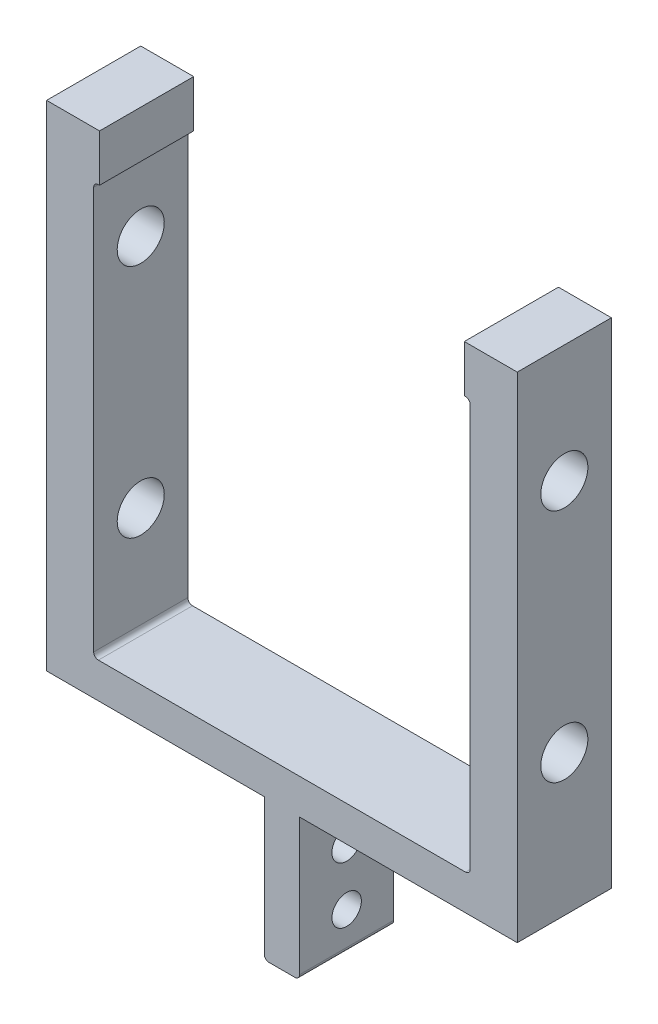
ISO-10303-21;
HEADER;
FILE_DESCRIPTION(('STEP AP214'),'2;1');
FILE_NAME('part.step','',(''),(''),'','','');
FILE_SCHEMA(('AUTOMOTIVE_DESIGN { 1 0 10303 214 1 1 1 1 }'));
ENDSEC;
DATA;
#1=APPLICATION_CONTEXT('core data for automotive mechanical design processes');
#2=APPLICATION_PROTOCOL_DEFINITION('international standard','automotive_design',2000,#1);
#3=PRODUCT_CONTEXT('',#1,'mechanical');
#4=PRODUCT('Part','Part','',(#3));
#5=PRODUCT_RELATED_PRODUCT_CATEGORY('part','',(#4));
#6=PRODUCT_DEFINITION_FORMATION('','',#4);
#7=PRODUCT_DEFINITION_CONTEXT('part definition',#1,'design');
#8=PRODUCT_DEFINITION('design','',#6,#7);
#9=PRODUCT_DEFINITION_SHAPE('','',#8);
#10=(LENGTH_UNIT() NAMED_UNIT(*) SI_UNIT(.MILLI.,.METRE.));
#11=(NAMED_UNIT(*) PLANE_ANGLE_UNIT() SI_UNIT($,.RADIAN.));
#12=(NAMED_UNIT(*) SI_UNIT($,.STERADIAN.) SOLID_ANGLE_UNIT());
#13=UNCERTAINTY_MEASURE_WITH_UNIT(LENGTH_MEASURE(1.E-05),#10,'distance_accuracy_value','');
#14=(GEOMETRIC_REPRESENTATION_CONTEXT(3) GLOBAL_UNCERTAINTY_ASSIGNED_CONTEXT((#13)) GLOBAL_UNIT_ASSIGNED_CONTEXT((#10,
#11,#12)) REPRESENTATION_CONTEXT('',''));
#15=CARTESIAN_POINT('',(0.,0.,0.));
#16=DIRECTION('',(0.,0.,1.));
#17=DIRECTION('',(1.,0.,0.));
#18=AXIS2_PLACEMENT_3D('',#15,#16,#17);
#19=CARTESIAN_POINT('',(49.2125,171.45,12.7));
#20=DIRECTION('',(1.,0.,0.));
#21=DIRECTION('',(0.,0.,-1.));
#22=AXIS2_PLACEMENT_3D('',#19,#20,#21);
#23=PLANE('',#22);
#24=DIRECTION('',(0.,-1.,0.));
#25=VECTOR('',#24,1.);
#26=CARTESIAN_POINT('',(49.2125,171.45,-12.7));
#27=LINE('',#26,#25);
#28=CARTESIAN_POINT('',(49.2125,171.45,-12.7));
#29=VERTEX_POINT('',#28);
#30=CARTESIAN_POINT('',(49.2125,158.75,-12.7));
#31=VERTEX_POINT('',#30);
#32=EDGE_CURVE('E207',#29,#31,#27,.T.);
#33=ORIENTED_EDGE('',*,*,#32,.T.);
#34=DIRECTION('',(0.,0.,-1.));
#35=VECTOR('',#34,1.);
#36=CARTESIAN_POINT('',(49.2125,158.75,12.7));
#37=LINE('',#36,#35);
#38=CARTESIAN_POINT('',(49.2125,158.75,12.7));
#39=VERTEX_POINT('',#38);
#40=EDGE_CURVE('E188',#39,#31,#37,.T.);
#41=ORIENTED_EDGE('',*,*,#40,.F.);
#42=DIRECTION('',(0.,-1.,0.));
#43=VECTOR('',#42,1.);
#44=CARTESIAN_POINT('',(49.2125,171.45,12.7));
#45=LINE('',#44,#43);
#46=CARTESIAN_POINT('',(49.2125,171.45,12.7));
#47=VERTEX_POINT('',#46);
#48=EDGE_CURVE('E194',#47,#39,#45,.T.);
#49=ORIENTED_EDGE('',*,*,#48,.F.);
#50=DIRECTION('',(0.,0.,-1.));
#51=VECTOR('',#50,1.);
#52=CARTESIAN_POINT('',(49.2125,171.45,12.7));
#53=LINE('',#52,#51);
#54=EDGE_CURVE('E310',#47,#29,#53,.T.);
#55=ORIENTED_EDGE('',*,*,#54,.T.);
#56=EDGE_LOOP('',(#33,#41,#49,#55));
#57=FACE_BOUND('',#56,.T.);
#58=ADVANCED_FACE('F35',(#57),#23,.F.);
#59=CARTESIAN_POINT('',(50.8,158.75,12.7));
#60=DIRECTION('',(0.,1.,0.));
#61=DIRECTION('',(-1.,0.,0.));
#62=AXIS2_PLACEMENT_3D('',#59,#60,#61);
#63=PLANE('',#62);
#64=DIRECTION('',(1.,0.,0.));
#65=VECTOR('',#64,1.);
#66=CARTESIAN_POINT('',(50.8,158.75,-12.7));
#67=LINE('',#66,#65);
#68=CARTESIAN_POINT('',(49.53,158.75,-12.7));
#69=VERTEX_POINT('',#68);
#70=EDGE_CURVE('E312',#31,#69,#67,.T.);
#71=ORIENTED_EDGE('',*,*,#70,.T.);
#72=DIRECTION('',(0.,0.,-1.));
#73=VECTOR('',#72,1.);
#74=CARTESIAN_POINT('',(49.53,158.75,12.7));
#75=LINE('',#74,#73);
#76=CARTESIAN_POINT('',(49.53,158.75,12.7));
#77=VERTEX_POINT('',#76);
#78=EDGE_CURVE('E191',#69,#77,#75,.F.);
#79=ORIENTED_EDGE('',*,*,#78,.T.);
#80=DIRECTION('',(1.,0.,0.));
#81=VECTOR('',#80,1.);
#82=CARTESIAN_POINT('',(50.8,158.75,12.7));
#83=LINE('',#82,#81);
#84=EDGE_CURVE('E183',#39,#77,#83,.T.);
#85=ORIENTED_EDGE('',*,*,#84,.F.);
#86=ORIENTED_EDGE('',*,*,#40,.T.);
#87=EDGE_LOOP('',(#71,#79,#85,#86));
#88=FACE_BOUND('',#87,.T.);
#89=ADVANCED_FACE('F186',(#88),#63,.F.);
#90=CARTESIAN_POINT('',(50.8,158.75,12.7));
#91=DIRECTION('',(1.,0.,0.));
#92=DIRECTION('',(0.,1.,0.));
#93=AXIS2_PLACEMENT_3D('',#90,#91,#92);
#94=PLANE('',#93);
#95=CARTESIAN_POINT('',(50.8,76.2,0.));
#96=DIRECTION('',(1.,0.,0.));
#97=DIRECTION('',(0.,1.,0.));
#98=AXIS2_PLACEMENT_3D('',#95,#96,#97);
#99=CIRCLE('',#98,6.34999999999673);
#100=CARTESIAN_POINT('',(50.8,82.5499999999967,0.));
#101=VERTEX_POINT('',#100);
#102=EDGE_CURVE('E313',#101,#101,#99,.T.);
#103=ORIENTED_EDGE('',*,*,#102,.T.);
#104=EDGE_LOOP('',(#103));
#105=FACE_BOUND('',#104,.T.);
#106=CARTESIAN_POINT('',(50.8,139.7,0.));
#107=DIRECTION('',(1.,0.,0.));
#108=DIRECTION('',(0.,1.,0.));
#109=AXIS2_PLACEMENT_3D('',#106,#107,#108);
#110=CIRCLE('',#109,6.34999999999999);
#111=CARTESIAN_POINT('',(50.8,146.05,0.));
#112=VERTEX_POINT('',#111);
#113=EDGE_CURVE('E456',#112,#112,#110,.T.);
#114=ORIENTED_EDGE('',*,*,#113,.T.);
#115=EDGE_LOOP('',(#114));
#116=FACE_BOUND('',#115,.T.);
#117=DIRECTION('',(0.,-1.,0.));
#118=VECTOR('',#117,1.);
#119=CARTESIAN_POINT('',(50.8,158.75,-12.7));
#120=LINE('',#119,#118);
#121=CARTESIAN_POINT('',(50.8,157.48,-12.7));
#122=VERTEX_POINT('',#121);
#123=CARTESIAN_POINT('',(50.8,48.895,-12.7));
#124=VERTEX_POINT('',#123);
#125=EDGE_CURVE('E315',#122,#124,#120,.T.);
#126=ORIENTED_EDGE('',*,*,#125,.T.);
#127=DIRECTION('',(0.,0.,-1.));
#128=VECTOR('',#127,1.);
#129=CARTESIAN_POINT('',(50.8,48.895,12.7));
#130=LINE('',#129,#128);
#131=CARTESIAN_POINT('',(50.8,48.895,12.7));
#132=VERTEX_POINT('',#131);
#133=EDGE_CURVE('E242',#124,#132,#130,.F.);
#134=ORIENTED_EDGE('',*,*,#133,.T.);
#135=DIRECTION('',(0.,-1.,0.));
#136=VECTOR('',#135,1.);
#137=CARTESIAN_POINT('',(50.8,158.75,12.7));
#138=LINE('',#137,#136);
#139=CARTESIAN_POINT('',(50.8,157.48,12.7));
#140=VERTEX_POINT('',#139);
#141=EDGE_CURVE('E193',#140,#132,#138,.T.);
#142=ORIENTED_EDGE('',*,*,#141,.F.);
#143=DIRECTION('',(0.,0.,-1.));
#144=VECTOR('',#143,1.);
#145=CARTESIAN_POINT('',(50.8,157.48,-12.7));
#146=LINE('',#145,#144);
#147=EDGE_CURVE('E239',#140,#122,#146,.T.);
#148=ORIENTED_EDGE('',*,*,#147,.T.);
#149=EDGE_LOOP('',(#126,#134,#142,#148));
#150=FACE_BOUND('',#149,.T.);
#151=ADVANCED_FACE('F395',(#105,#116,#150),#94,.F.);
#152=CARTESIAN_POINT('',(-50.8,47.625,12.7));
#153=DIRECTION('',(0.,-1.,0.));
#154=DIRECTION('',(1.,0.,0.));
#155=AXIS2_PLACEMENT_3D('',#152,#153,#154);
#156=PLANE('',#155);
#157=DIRECTION('',(-1.,0.,0.));
#158=VECTOR('',#157,1.);
#159=CARTESIAN_POINT('',(-50.8,47.625,-12.7));
#160=LINE('',#159,#158);
#161=CARTESIAN_POINT('',(49.53,47.625,-12.7));
#162=VERTEX_POINT('',#161);
#163=CARTESIAN_POINT('',(-49.53,47.625,-12.7));
#164=VERTEX_POINT('',#163);
#165=EDGE_CURVE('E278',#162,#164,#160,.T.);
#166=ORIENTED_EDGE('',*,*,#165,.T.);
#167=DIRECTION('',(0.,0.,-1.));
#168=VECTOR('',#167,1.);
#169=CARTESIAN_POINT('',(-49.53,47.625,12.7));
#170=LINE('',#169,#168);
#171=CARTESIAN_POINT('',(-49.53,47.625,12.7));
#172=VERTEX_POINT('',#171);
#173=EDGE_CURVE('E237',#164,#172,#170,.F.);
#174=ORIENTED_EDGE('',*,*,#173,.T.);
#175=DIRECTION('',(-1.,0.,0.));
#176=VECTOR('',#175,1.);
#177=CARTESIAN_POINT('',(-50.8,47.625,12.7));
#178=LINE('',#177,#176);
#179=CARTESIAN_POINT('',(49.53,47.625,12.7));
#180=VERTEX_POINT('',#179);
#181=EDGE_CURVE('E290',#180,#172,#178,.T.);
#182=ORIENTED_EDGE('',*,*,#181,.F.);
#183=DIRECTION('',(0.,0.,-1.));
#184=VECTOR('',#183,1.);
#185=CARTESIAN_POINT('',(49.53,47.625,-12.7));
#186=LINE('',#185,#184);
#187=EDGE_CURVE('E234',#180,#162,#186,.T.);
#188=ORIENTED_EDGE('',*,*,#187,.T.);
#189=EDGE_LOOP('',(#166,#174,#182,#188));
#190=FACE_BOUND('',#189,.T.);
#191=ADVANCED_FACE('F535',(#190),#156,.F.);
#192=CARTESIAN_POINT('',(-50.8,158.75,12.7));
#193=DIRECTION('',(-1.,0.,0.));
#194=DIRECTION('',(0.,-1.,0.));
#195=AXIS2_PLACEMENT_3D('',#192,#193,#194);
#196=PLANE('',#195);
#197=CARTESIAN_POINT('',(-50.8,76.2,0.));
#198=DIRECTION('',(-1.,0.,0.));
#199=DIRECTION('',(0.,-1.,0.));
#200=AXIS2_PLACEMENT_3D('',#197,#198,#199);
#201=CIRCLE('',#200,6.34999999999673);
#202=CARTESIAN_POINT('',(-50.8,69.8500000000033,0.));
#203=VERTEX_POINT('',#202);
#204=EDGE_CURVE('E453',#203,#203,#201,.T.);
#205=ORIENTED_EDGE('',*,*,#204,.T.);
#206=EDGE_LOOP('',(#205));
#207=FACE_BOUND('',#206,.T.);
#208=CARTESIAN_POINT('',(-50.8,139.7,0.));
#209=DIRECTION('',(-1.,0.,0.));
#210=DIRECTION('',(0.,-1.,0.));
#211=AXIS2_PLACEMENT_3D('',#208,#209,#210);
#212=CIRCLE('',#211,6.34999999999999);
#213=CARTESIAN_POINT('',(-50.8,133.35,0.));
#214=VERTEX_POINT('',#213);
#215=EDGE_CURVE('E459',#214,#214,#212,.T.);
#216=ORIENTED_EDGE('',*,*,#215,.T.);
#217=EDGE_LOOP('',(#216));
#218=FACE_BOUND('',#217,.T.);
#219=DIRECTION('',(0.,1.,0.));
#220=VECTOR('',#219,1.);
#221=CARTESIAN_POINT('',(-50.8,158.75,12.7));
#222=LINE('',#221,#220);
#223=CARTESIAN_POINT('',(-50.8,48.8950000000001,12.7));
#224=VERTEX_POINT('',#223);
#225=CARTESIAN_POINT('',(-50.8,157.48,12.7));
#226=VERTEX_POINT('',#225);
#227=EDGE_CURVE('E286',#224,#226,#222,.T.);
#228=ORIENTED_EDGE('',*,*,#227,.F.);
#229=DIRECTION('',(0.,0.,-1.));
#230=VECTOR('',#229,1.);
#231=CARTESIAN_POINT('',(-50.8,48.895,-12.7));
#232=LINE('',#231,#230);
#233=CARTESIAN_POINT('',(-50.8,48.8950000000001,-12.7));
#234=VERTEX_POINT('',#233);
#235=EDGE_CURVE('E231',#224,#234,#232,.T.);
#236=ORIENTED_EDGE('',*,*,#235,.T.);
#237=DIRECTION('',(0.,1.,0.));
#238=VECTOR('',#237,1.);
#239=CARTESIAN_POINT('',(-50.8,158.75,-12.7));
#240=LINE('',#239,#238);
#241=CARTESIAN_POINT('',(-50.8,157.48,-12.7));
#242=VERTEX_POINT('',#241);
#243=EDGE_CURVE('E268',#234,#242,#240,.T.);
#244=ORIENTED_EDGE('',*,*,#243,.T.);
#245=DIRECTION('',(0.,0.,-1.));
#246=VECTOR('',#245,1.);
#247=CARTESIAN_POINT('',(-50.8,157.48,12.7));
#248=LINE('',#247,#246);
#249=EDGE_CURVE('E229',#242,#226,#248,.F.);
#250=ORIENTED_EDGE('',*,*,#249,.T.);
#251=EDGE_LOOP('',(#228,#236,#244,#250));
#252=FACE_BOUND('',#251,.T.);
#253=ADVANCED_FACE('F276',(#207,#218,#252),#196,.F.);
#254=CARTESIAN_POINT('',(-49.2125,158.75,12.7));
#255=DIRECTION('',(0.,1.,0.));
#256=DIRECTION('',(-1.,0.,0.));
#257=AXIS2_PLACEMENT_3D('',#254,#255,#256);
#258=PLANE('',#257);
#259=DIRECTION('',(1.,0.,0.));
#260=VECTOR('',#259,1.);
#261=CARTESIAN_POINT('',(-49.2125,158.75,12.7));
#262=LINE('',#261,#260);
#263=CARTESIAN_POINT('',(-49.53,158.75,12.7));
#264=VERTEX_POINT('',#263);
#265=CARTESIAN_POINT('',(-49.2125,158.75,12.7));
#266=VERTEX_POINT('',#265);
#267=EDGE_CURVE('E283',#264,#266,#262,.T.);
#268=ORIENTED_EDGE('',*,*,#267,.F.);
#269=DIRECTION('',(0.,0.,-1.));
#270=VECTOR('',#269,1.);
#271=CARTESIAN_POINT('',(-49.53,158.75,-12.7));
#272=LINE('',#271,#270);
#273=CARTESIAN_POINT('',(-49.53,158.75,-12.7));
#274=VERTEX_POINT('',#273);
#275=EDGE_CURVE('E248',#264,#274,#272,.T.);
#276=ORIENTED_EDGE('',*,*,#275,.T.);
#277=DIRECTION('',(1.,0.,0.));
#278=VECTOR('',#277,1.);
#279=CARTESIAN_POINT('',(-49.2125,158.75,-12.7));
#280=LINE('',#279,#278);
#281=CARTESIAN_POINT('',(-49.2125,158.75,-12.7));
#282=VERTEX_POINT('',#281);
#283=EDGE_CURVE('E270',#274,#282,#280,.T.);
#284=ORIENTED_EDGE('',*,*,#283,.T.);
#285=DIRECTION('',(0.,0.,-1.));
#286=VECTOR('',#285,1.);
#287=CARTESIAN_POINT('',(-49.2125,158.75,12.7));
#288=LINE('',#287,#286);
#289=EDGE_CURVE('E209',#266,#282,#288,.T.);
#290=ORIENTED_EDGE('',*,*,#289,.F.);
#291=EDGE_LOOP('',(#268,#276,#284,#290));
#292=FACE_BOUND('',#291,.T.);
#293=ADVANCED_FACE('F281',(#292),#258,.F.);
#294=CARTESIAN_POINT('',(-49.2125,158.75,12.7));
#295=DIRECTION('',(-1.,0.,0.));
#296=DIRECTION('',(0.,-1.,0.));
#297=AXIS2_PLACEMENT_3D('',#294,#295,#296);
#298=PLANE('',#297);
#299=DIRECTION('',(0.,1.,0.));
#300=VECTOR('',#299,1.);
#301=CARTESIAN_POINT('',(-49.2125,158.75,-12.7));
#302=LINE('',#301,#300);
#303=CARTESIAN_POINT('',(-49.2125,171.45,-12.7));
#304=VERTEX_POINT('',#303);
#305=EDGE_CURVE('E321',#282,#304,#302,.T.);
#306=ORIENTED_EDGE('',*,*,#305,.T.);
#307=DIRECTION('',(0.,0.,-1.));
#308=VECTOR('',#307,1.);
#309=CARTESIAN_POINT('',(-49.2125,171.45,12.7));
#310=LINE('',#309,#308);
#311=CARTESIAN_POINT('',(-49.2125,171.45,12.7));
#312=VERTEX_POINT('',#311);
#313=EDGE_CURVE('E214',#312,#304,#310,.T.);
#314=ORIENTED_EDGE('',*,*,#313,.F.);
#315=DIRECTION('',(0.,1.,0.));
#316=VECTOR('',#315,1.);
#317=CARTESIAN_POINT('',(-49.2125,158.75,12.7));
#318=LINE('',#317,#316);
#319=EDGE_CURVE('E285',#266,#312,#318,.T.);
#320=ORIENTED_EDGE('',*,*,#319,.F.);
#321=ORIENTED_EDGE('',*,*,#289,.T.);
#322=EDGE_LOOP('',(#306,#314,#320,#321));
#323=FACE_BOUND('',#322,.T.);
#324=ADVANCED_FACE('F381',(#323),#298,.F.);
#325=CARTESIAN_POINT('',(-49.2125,171.45,12.7));
#326=DIRECTION('',(0.,-1.,0.));
#327=DIRECTION('',(0.,0.,-1.));
#328=AXIS2_PLACEMENT_3D('',#325,#326,#327);
#329=PLANE('',#328);
#330=DIRECTION('',(-1.,0.,0.));
#331=VECTOR('',#330,1.);
#332=CARTESIAN_POINT('',(-49.2125,171.45,-12.7));
#333=LINE('',#332,#331);
#334=CARTESIAN_POINT('',(-63.5,171.45,-12.7));
#335=VERTEX_POINT('',#334);
#336=EDGE_CURVE('E323',#304,#335,#333,.T.);
#337=ORIENTED_EDGE('',*,*,#336,.T.);
#338=DIRECTION('',(0.,0.,-1.));
#339=VECTOR('',#338,1.);
#340=CARTESIAN_POINT('',(-63.5,171.45,12.7));
#341=LINE('',#340,#339);
#342=CARTESIAN_POINT('',(-63.5,171.45,12.7));
#343=VERTEX_POINT('',#342);
#344=EDGE_CURVE('E358',#343,#335,#341,.T.);
#345=ORIENTED_EDGE('',*,*,#344,.F.);
#346=DIRECTION('',(-1.,0.,0.));
#347=VECTOR('',#346,1.);
#348=CARTESIAN_POINT('',(-49.2125,171.45,12.7));
#349=LINE('',#348,#347);
#350=EDGE_CURVE('E288',#312,#343,#349,.T.);
#351=ORIENTED_EDGE('',*,*,#350,.F.);
#352=ORIENTED_EDGE('',*,*,#313,.T.);
#353=EDGE_LOOP('',(#337,#345,#351,#352));
#354=FACE_BOUND('',#353,.T.);
#355=ADVANCED_FACE('F365',(#354),#329,.F.);
#356=CARTESIAN_POINT('',(-63.5,38.1,12.7));
#357=DIRECTION('',(1.,0.,0.));
#358=DIRECTION('',(0.,0.,-1.));
#359=AXIS2_PLACEMENT_3D('',#356,#357,#358);
#360=PLANE('',#359);
#361=CARTESIAN_POINT('',(-63.5,76.2,0.));
#362=DIRECTION('',(-1.,0.,0.));
#363=DIRECTION('',(0.,-1.,0.));
#364=AXIS2_PLACEMENT_3D('',#361,#362,#363);
#365=CIRCLE('',#364,6.34999999999673);
#366=CARTESIAN_POINT('',(-63.5,69.8500000000033,0.));
#367=VERTEX_POINT('',#366);
#368=EDGE_CURVE('E470',#367,#367,#365,.T.);
#369=ORIENTED_EDGE('',*,*,#368,.F.);
#370=EDGE_LOOP('',(#369));
#371=FACE_BOUND('',#370,.T.);
#372=CARTESIAN_POINT('',(-63.5,139.7,0.));
#373=DIRECTION('',(-1.,0.,0.));
#374=DIRECTION('',(0.,-1.,0.));
#375=AXIS2_PLACEMENT_3D('',#372,#373,#374);
#376=CIRCLE('',#375,6.34999999999999);
#377=CARTESIAN_POINT('',(-63.5,133.35,0.));
#378=VERTEX_POINT('',#377);
#379=EDGE_CURVE('E463',#378,#378,#376,.T.);
#380=ORIENTED_EDGE('',*,*,#379,.F.);
#381=EDGE_LOOP('',(#380));
#382=FACE_BOUND('',#381,.T.);
#383=DIRECTION('',(0.,-1.,0.));
#384=VECTOR('',#383,1.);
#385=CARTESIAN_POINT('',(-63.5,38.1,-12.7));
#386=LINE('',#385,#384);
#387=CARTESIAN_POINT('',(-63.5,38.1,-12.7));
#388=VERTEX_POINT('',#387);
#389=EDGE_CURVE('E325',#335,#388,#386,.T.);
#390=ORIENTED_EDGE('',*,*,#389,.T.);
#391=DIRECTION('',(0.,0.,-1.));
#392=VECTOR('',#391,1.);
#393=CARTESIAN_POINT('',(-63.5,38.1,12.7));
#394=LINE('',#393,#392);
#395=CARTESIAN_POINT('',(-63.5,38.1,12.7));
#396=VERTEX_POINT('',#395);
#397=EDGE_CURVE('E355',#396,#388,#394,.T.);
#398=ORIENTED_EDGE('',*,*,#397,.F.);
#399=DIRECTION('',(0.,-1.,0.));
#400=VECTOR('',#399,1.);
#401=CARTESIAN_POINT('',(-63.5,38.1,12.7));
#402=LINE('',#401,#400);
#403=EDGE_CURVE('E295',#343,#396,#402,.T.);
#404=ORIENTED_EDGE('',*,*,#403,.F.);
#405=ORIENTED_EDGE('',*,*,#344,.T.);
#406=EDGE_LOOP('',(#390,#398,#404,#405));
#407=FACE_BOUND('',#406,.T.);
#408=ADVANCED_FACE('F373',(#371,#382,#407),#360,.F.);
#409=CARTESIAN_POINT('',(-4.7625,38.1,12.7));
#410=DIRECTION('',(0.,1.,0.));
#411=DIRECTION('',(-1.,0.,0.));
#412=AXIS2_PLACEMENT_3D('',#409,#410,#411);
#413=PLANE('',#412);
#414=DIRECTION('',(1.,0.,0.));
#415=VECTOR('',#414,1.);
#416=CARTESIAN_POINT('',(-4.7625,38.1,-12.7));
#417=LINE('',#416,#415);
#418=CARTESIAN_POINT('',(-4.7625,38.1,-12.7));
#419=VERTEX_POINT('',#418);
#420=EDGE_CURVE('E327',#388,#419,#417,.T.);
#421=ORIENTED_EDGE('',*,*,#420,.T.);
#422=DIRECTION('',(0.,0.,-1.));
#423=VECTOR('',#422,1.);
#424=CARTESIAN_POINT('',(-4.7625,38.1,12.7));
#425=LINE('',#424,#423);
#426=CARTESIAN_POINT('',(-4.7625,38.1,12.7));
#427=VERTEX_POINT('',#426);
#428=EDGE_CURVE('E352',#427,#419,#425,.T.);
#429=ORIENTED_EDGE('',*,*,#428,.F.);
#430=DIRECTION('',(1.,0.,0.));
#431=VECTOR('',#430,1.);
#432=CARTESIAN_POINT('',(-4.7625,38.1,12.7));
#433=LINE('',#432,#431);
#434=EDGE_CURVE('E297',#396,#427,#433,.T.);
#435=ORIENTED_EDGE('',*,*,#434,.F.);
#436=ORIENTED_EDGE('',*,*,#397,.T.);
#437=EDGE_LOOP('',(#421,#429,#435,#436));
#438=FACE_BOUND('',#437,.T.);
#439=ADVANCED_FACE('F377',(#438),#413,.F.);
#440=CARTESIAN_POINT('',(-4.7625,0.,12.7));
#441=DIRECTION('',(1.,0.,0.));
#442=DIRECTION('',(0.,0.,-1.));
#443=AXIS2_PLACEMENT_3D('',#440,#441,#442);
#444=PLANE('',#443);
#445=CARTESIAN_POINT('',(-4.7625,25.4,0.));
#446=DIRECTION('',(1.,0.,0.));
#447=DIRECTION('',(0.,0.,-1.));
#448=AXIS2_PLACEMENT_3D('',#445,#446,#447);
#449=CIRCLE('',#448,3.97256);
#450=CARTESIAN_POINT('',(-4.7625,25.4,-3.97256));
#451=VERTEX_POINT('',#450);
#452=EDGE_CURVE('E480',#451,#451,#449,.T.);
#453=ORIENTED_EDGE('',*,*,#452,.T.);
#454=EDGE_LOOP('',(#453));
#455=FACE_BOUND('',#454,.T.);
#456=CARTESIAN_POINT('',(-4.7625,10.16,0.));
#457=DIRECTION('',(1.,0.,0.));
#458=DIRECTION('',(0.,0.,-1.));
#459=AXIS2_PLACEMENT_3D('',#456,#457,#458);
#460=CIRCLE('',#459,3.97256);
#461=CARTESIAN_POINT('',(-4.7625,10.16,-3.97256));
#462=VERTEX_POINT('',#461);
#463=EDGE_CURVE('E467',#462,#462,#460,.T.);
#464=ORIENTED_EDGE('',*,*,#463,.T.);
#465=EDGE_LOOP('',(#464));
#466=FACE_BOUND('',#465,.T.);
#467=DIRECTION('',(0.,-1.,0.));
#468=VECTOR('',#467,1.);
#469=CARTESIAN_POINT('',(-4.7625,0.,-12.7));
#470=LINE('',#469,#468);
#471=CARTESIAN_POINT('',(-4.7625,1.27,-12.7));
#472=VERTEX_POINT('',#471);
#473=EDGE_CURVE('E329',#419,#472,#470,.T.);
#474=ORIENTED_EDGE('',*,*,#473,.T.);
#475=DIRECTION('',(0.,0.,-1.));
#476=VECTOR('',#475,1.);
#477=CARTESIAN_POINT('',(-4.7625,1.27,12.7));
#478=LINE('',#477,#476);
#479=CARTESIAN_POINT('',(-4.7625,1.27,12.7));
#480=VERTEX_POINT('',#479);
#481=EDGE_CURVE('E224',#472,#480,#478,.F.);
#482=ORIENTED_EDGE('',*,*,#481,.T.);
#483=DIRECTION('',(0.,-1.,0.));
#484=VECTOR('',#483,1.);
#485=CARTESIAN_POINT('',(-4.7625,0.,12.7));
#486=LINE('',#485,#484);
#487=EDGE_CURVE('E299',#427,#480,#486,.T.);
#488=ORIENTED_EDGE('',*,*,#487,.F.);
#489=ORIENTED_EDGE('',*,*,#428,.T.);
#490=EDGE_LOOP('',(#474,#482,#488,#489));
#491=FACE_BOUND('',#490,.T.);
#492=ADVANCED_FACE('F501',(#455,#466,#491),#444,.F.);
#493=CARTESIAN_POINT('',(4.7625,0.,12.7));
#494=DIRECTION('',(0.,1.,0.));
#495=DIRECTION('',(-1.,0.,0.));
#496=AXIS2_PLACEMENT_3D('',#493,#494,#495);
#497=PLANE('',#496);
#498=DIRECTION('',(1.,0.,0.));
#499=VECTOR('',#498,1.);
#500=CARTESIAN_POINT('',(4.7625,0.,12.7));
#501=LINE('',#500,#499);
#502=CARTESIAN_POINT('',(-3.49249999999999,0.,12.7));
#503=VERTEX_POINT('',#502);
#504=CARTESIAN_POINT('',(3.4925,0.,12.7));
#505=VERTEX_POINT('',#504);
#506=EDGE_CURVE('E301',#503,#505,#501,.T.);
#507=ORIENTED_EDGE('',*,*,#506,.F.);
#508=DIRECTION('',(0.,0.,-1.));
#509=VECTOR('',#508,1.);
#510=CARTESIAN_POINT('',(-3.4925,0.,12.7));
#511=LINE('',#510,#509);
#512=CARTESIAN_POINT('',(-3.49249999999999,0.,-12.7));
#513=VERTEX_POINT('',#512);
#514=EDGE_CURVE('E211',#503,#513,#511,.T.);
#515=ORIENTED_EDGE('',*,*,#514,.T.);
#516=DIRECTION('',(1.,0.,0.));
#517=VECTOR('',#516,1.);
#518=CARTESIAN_POINT('',(4.7625,0.,-12.7));
#519=LINE('',#518,#517);
#520=CARTESIAN_POINT('',(3.4925,0.,-12.7));
#521=VERTEX_POINT('',#520);
#522=EDGE_CURVE('E332',#513,#521,#519,.T.);
#523=ORIENTED_EDGE('',*,*,#522,.T.);
#524=DIRECTION('',(0.,0.,-1.));
#525=VECTOR('',#524,1.);
#526=CARTESIAN_POINT('',(3.4925,0.,12.7));
#527=LINE('',#526,#525);
#528=EDGE_CURVE('E208',#521,#505,#527,.F.);
#529=ORIENTED_EDGE('',*,*,#528,.T.);
#530=EDGE_LOOP('',(#507,#515,#523,#529));
#531=FACE_BOUND('',#530,.T.);
#532=ADVANCED_FACE('F492',(#531),#497,.F.);
#533=CARTESIAN_POINT('',(4.7625,0.,12.7));
#534=DIRECTION('',(-1.,0.,0.));
#535=DIRECTION('',(0.,-1.,0.));
#536=AXIS2_PLACEMENT_3D('',#533,#534,#535);
#537=PLANE('',#536);
#538=CARTESIAN_POINT('',(4.7625,25.4,0.));
#539=DIRECTION('',(1.,0.,0.));
#540=DIRECTION('',(0.,0.,-1.));
#541=AXIS2_PLACEMENT_3D('',#538,#539,#540);
#542=CIRCLE('',#541,3.97256);
#543=CARTESIAN_POINT('',(4.7625,25.4,-3.97256));
#544=VERTEX_POINT('',#543);
#545=EDGE_CURVE('E483',#544,#544,#542,.T.);
#546=ORIENTED_EDGE('',*,*,#545,.F.);
#547=EDGE_LOOP('',(#546));
#548=FACE_BOUND('',#547,.T.);
#549=CARTESIAN_POINT('',(4.7625,10.16,0.));
#550=DIRECTION('',(1.,0.,0.));
#551=DIRECTION('',(0.,0.,-1.));
#552=AXIS2_PLACEMENT_3D('',#549,#550,#551);
#553=CIRCLE('',#552,3.97256);
#554=CARTESIAN_POINT('',(4.7625,10.16,-3.97256));
#555=VERTEX_POINT('',#554);
#556=EDGE_CURVE('E477',#555,#555,#553,.T.);
#557=ORIENTED_EDGE('',*,*,#556,.F.);
#558=EDGE_LOOP('',(#557));
#559=FACE_BOUND('',#558,.T.);
#560=DIRECTION('',(0.,1.,0.));
#561=VECTOR('',#560,1.);
#562=CARTESIAN_POINT('',(4.7625,0.,12.7));
#563=LINE('',#562,#561);
#564=CARTESIAN_POINT('',(4.7625,1.27,12.7));
#565=VERTEX_POINT('',#564);
#566=CARTESIAN_POINT('',(4.76249999999999,38.1,12.7));
#567=VERTEX_POINT('',#566);
#568=EDGE_CURVE('E303',#565,#567,#563,.T.);
#569=ORIENTED_EDGE('',*,*,#568,.F.);
#570=DIRECTION('',(0.,0.,-1.));
#571=VECTOR('',#570,1.);
#572=CARTESIAN_POINT('',(4.7625,1.27,12.7));
#573=LINE('',#572,#571);
#574=CARTESIAN_POINT('',(4.7625,1.27,-12.7));
#575=VERTEX_POINT('',#574);
#576=EDGE_CURVE('E245',#565,#575,#573,.T.);
#577=ORIENTED_EDGE('',*,*,#576,.T.);
#578=DIRECTION('',(0.,1.,0.));
#579=VECTOR('',#578,1.);
#580=CARTESIAN_POINT('',(4.7625,0.,-12.7));
#581=LINE('',#580,#579);
#582=CARTESIAN_POINT('',(4.76249999999999,38.1,-12.7));
#583=VERTEX_POINT('',#582);
#584=EDGE_CURVE('E335',#575,#583,#581,.T.);
#585=ORIENTED_EDGE('',*,*,#584,.T.);
#586=DIRECTION('',(0.,0.,-1.));
#587=VECTOR('',#586,1.);
#588=CARTESIAN_POINT('',(4.76249999999999,38.1,12.7));
#589=LINE('',#588,#587);
#590=EDGE_CURVE('E349',#567,#583,#589,.T.);
#591=ORIENTED_EDGE('',*,*,#590,.F.);
#592=EDGE_LOOP('',(#569,#577,#585,#591));
#593=FACE_BOUND('',#592,.T.);
#594=ADVANCED_FACE('F426',(#548,#559,#593),#537,.F.);
#595=CARTESIAN_POINT('',(4.76249999999999,38.1,12.7));
#596=DIRECTION('',(0.,1.,0.));
#597=DIRECTION('',(0.,0.,1.));
#598=AXIS2_PLACEMENT_3D('',#595,#596,#597);
#599=PLANE('',#598);
#600=DIRECTION('',(1.,0.,0.));
#601=VECTOR('',#600,1.);
#602=CARTESIAN_POINT('',(4.76249999999999,38.1,-12.7));
#603=LINE('',#602,#601);
#604=CARTESIAN_POINT('',(63.5,38.1,-12.7));
#605=VERTEX_POINT('',#604);
#606=EDGE_CURVE('E337',#583,#605,#603,.T.);
#607=ORIENTED_EDGE('',*,*,#606,.T.);
#608=DIRECTION('',(0.,0.,-1.));
#609=VECTOR('',#608,1.);
#610=CARTESIAN_POINT('',(63.5,38.1,12.7));
#611=LINE('',#610,#609);
#612=CARTESIAN_POINT('',(63.5,38.1,12.7));
#613=VERTEX_POINT('',#612);
#614=EDGE_CURVE('E346',#613,#605,#611,.T.);
#615=ORIENTED_EDGE('',*,*,#614,.F.);
#616=DIRECTION('',(1.,0.,0.));
#617=VECTOR('',#616,1.);
#618=CARTESIAN_POINT('',(4.76249999999999,38.1,12.7));
#619=LINE('',#618,#617);
#620=EDGE_CURVE('E305',#567,#613,#619,.T.);
#621=ORIENTED_EDGE('',*,*,#620,.F.);
#622=ORIENTED_EDGE('',*,*,#590,.T.);
#623=EDGE_LOOP('',(#607,#615,#621,#622));
#624=FACE_BOUND('',#623,.T.);
#625=ADVANCED_FACE('F433',(#624),#599,.F.);
#626=CARTESIAN_POINT('',(63.5,38.1,12.7));
#627=DIRECTION('',(-1.,0.,0.));
#628=DIRECTION('',(0.,-1.,0.));
#629=AXIS2_PLACEMENT_3D('',#626,#627,#628);
#630=PLANE('',#629);
#631=CARTESIAN_POINT('',(63.5,76.2,0.));
#632=DIRECTION('',(-1.,0.,0.));
#633=DIRECTION('',(0.,-1.,0.));
#634=AXIS2_PLACEMENT_3D('',#631,#632,#633);
#635=CIRCLE('',#634,6.34999999999673);
#636=CARTESIAN_POINT('',(63.5,69.8500000000033,0.));
#637=VERTEX_POINT('',#636);
#638=EDGE_CURVE('E462',#637,#637,#635,.T.);
#639=ORIENTED_EDGE('',*,*,#638,.T.);
#640=EDGE_LOOP('',(#639));
#641=FACE_BOUND('',#640,.T.);
#642=CARTESIAN_POINT('',(63.5,139.7,0.));
#643=DIRECTION('',(-1.,0.,0.));
#644=DIRECTION('',(0.,-1.,0.));
#645=AXIS2_PLACEMENT_3D('',#642,#643,#644);
#646=CIRCLE('',#645,6.34999999999999);
#647=CARTESIAN_POINT('',(63.5,133.35,0.));
#648=VERTEX_POINT('',#647);
#649=EDGE_CURVE('E466',#648,#648,#646,.T.);
#650=ORIENTED_EDGE('',*,*,#649,.T.);
#651=EDGE_LOOP('',(#650));
#652=FACE_BOUND('',#651,.T.);
#653=DIRECTION('',(0.,1.,0.));
#654=VECTOR('',#653,1.);
#655=CARTESIAN_POINT('',(63.5,38.1,-12.7));
#656=LINE('',#655,#654);
#657=CARTESIAN_POINT('',(63.5,171.45,-12.7));
#658=VERTEX_POINT('',#657);
#659=EDGE_CURVE('E339',#605,#658,#656,.T.);
#660=ORIENTED_EDGE('',*,*,#659,.T.);
#661=DIRECTION('',(0.,0.,-1.));
#662=VECTOR('',#661,1.);
#663=CARTESIAN_POINT('',(63.5,171.45,12.7));
#664=LINE('',#663,#662);
#665=CARTESIAN_POINT('',(63.5,171.45,12.7));
#666=VERTEX_POINT('',#665);
#667=EDGE_CURVE('E343',#666,#658,#664,.T.);
#668=ORIENTED_EDGE('',*,*,#667,.F.);
#669=DIRECTION('',(0.,1.,0.));
#670=VECTOR('',#669,1.);
#671=CARTESIAN_POINT('',(63.5,38.1,12.7));
#672=LINE('',#671,#670);
#673=EDGE_CURVE('E307',#613,#666,#672,.T.);
#674=ORIENTED_EDGE('',*,*,#673,.F.);
#675=ORIENTED_EDGE('',*,*,#614,.T.);
#676=EDGE_LOOP('',(#660,#668,#674,#675));
#677=FACE_BOUND('',#676,.T.);
#678=ADVANCED_FACE('F437',(#641,#652,#677),#630,.F.);
#679=CARTESIAN_POINT('',(63.5,171.45,12.7));
#680=DIRECTION('',(0.,-1.,0.));
#681=DIRECTION('',(1.,0.,0.));
#682=AXIS2_PLACEMENT_3D('',#679,#680,#681);
#683=PLANE('',#682);
#684=DIRECTION('',(-1.,0.,0.));
#685=VECTOR('',#684,1.);
#686=CARTESIAN_POINT('',(63.5,171.45,-12.7));
#687=LINE('',#686,#685);
#688=EDGE_CURVE('E204',#658,#29,#687,.T.);
#689=ORIENTED_EDGE('',*,*,#688,.T.);
#690=ORIENTED_EDGE('',*,*,#54,.F.);
#691=DIRECTION('',(-1.,0.,0.));
#692=VECTOR('',#691,1.);
#693=CARTESIAN_POINT('',(63.5,171.45,12.7));
#694=LINE('',#693,#692);
#695=EDGE_CURVE('E200',#666,#47,#694,.T.);
#696=ORIENTED_EDGE('',*,*,#695,.F.);
#697=ORIENTED_EDGE('',*,*,#667,.T.);
#698=EDGE_LOOP('',(#689,#690,#696,#697));
#699=FACE_BOUND('',#698,.T.);
#700=ADVANCED_FACE('F440',(#699),#683,.F.);
#701=CARTESIAN_POINT('',(0.,0.,12.7));
#702=DIRECTION('',(0.,0.,-1.));
#703=DIRECTION('',(-1.,0.,0.));
#704=AXIS2_PLACEMENT_3D('',#701,#702,#703);
#705=PLANE('',#704);
#706=ORIENTED_EDGE('',*,*,#487,.T.);
#707=CARTESIAN_POINT('',(-3.4925,1.27,12.7));
#708=DIRECTION('',(0.,0.,-1.));
#709=DIRECTION('',(-1.,0.,0.));
#710=AXIS2_PLACEMENT_3D('',#707,#708,#709);
#711=CIRCLE('',#710,1.27);
#712=EDGE_CURVE('E227',#480,#503,#711,.F.);
#713=ORIENTED_EDGE('',*,*,#712,.T.);
#714=ORIENTED_EDGE('',*,*,#506,.T.);
#715=CARTESIAN_POINT('',(3.4925,1.27,12.7));
#716=DIRECTION('',(0.,0.,-1.));
#717=DIRECTION('',(-1.,0.,0.));
#718=AXIS2_PLACEMENT_3D('',#715,#716,#717);
#719=CIRCLE('',#718,1.27);
#720=EDGE_CURVE('E50',#505,#565,#719,.F.);
#721=ORIENTED_EDGE('',*,*,#720,.T.);
#722=ORIENTED_EDGE('',*,*,#568,.T.);
#723=ORIENTED_EDGE('',*,*,#620,.T.);
#724=ORIENTED_EDGE('',*,*,#673,.T.);
#725=ORIENTED_EDGE('',*,*,#695,.T.);
#726=ORIENTED_EDGE('',*,*,#48,.T.);
#727=ORIENTED_EDGE('',*,*,#84,.T.);
#728=CARTESIAN_POINT('',(49.53,157.48,12.7));
#729=DIRECTION('',(0.,0.,-1.));
#730=DIRECTION('',(-1.,0.,0.));
#731=AXIS2_PLACEMENT_3D('',#728,#729,#730);
#732=CIRCLE('',#731,1.27);
#733=EDGE_CURVE('E261',#77,#140,#732,.T.);
#734=ORIENTED_EDGE('',*,*,#733,.T.);
#735=ORIENTED_EDGE('',*,*,#141,.T.);
#736=CARTESIAN_POINT('',(49.53,48.895,12.7));
#737=DIRECTION('',(0.,0.,-1.));
#738=DIRECTION('',(-1.,0.,0.));
#739=AXIS2_PLACEMENT_3D('',#736,#737,#738);
#740=CIRCLE('',#739,1.27);
#741=EDGE_CURVE('E257',#132,#180,#740,.T.);
#742=ORIENTED_EDGE('',*,*,#741,.T.);
#743=ORIENTED_EDGE('',*,*,#181,.T.);
#744=CARTESIAN_POINT('',(-49.53,48.895,12.7));
#745=DIRECTION('',(0.,0.,-1.));
#746=DIRECTION('',(-1.,0.,0.));
#747=AXIS2_PLACEMENT_3D('',#744,#745,#746);
#748=CIRCLE('',#747,1.27);
#749=EDGE_CURVE('E253',#172,#224,#748,.T.);
#750=ORIENTED_EDGE('',*,*,#749,.T.);
#751=ORIENTED_EDGE('',*,*,#227,.T.);
#752=CARTESIAN_POINT('',(-49.53,157.48,12.7));
#753=DIRECTION('',(0.,0.,-1.));
#754=DIRECTION('',(-1.,0.,0.));
#755=AXIS2_PLACEMENT_3D('',#752,#753,#754);
#756=CIRCLE('',#755,1.27);
#757=EDGE_CURVE('E11',#226,#264,#756,.T.);
#758=ORIENTED_EDGE('',*,*,#757,.T.);
#759=ORIENTED_EDGE('',*,*,#267,.T.);
#760=ORIENTED_EDGE('',*,*,#319,.T.);
#761=ORIENTED_EDGE('',*,*,#350,.T.);
#762=ORIENTED_EDGE('',*,*,#403,.T.);
#763=ORIENTED_EDGE('',*,*,#434,.T.);
#764=EDGE_LOOP('',(#706,#713,#714,#721,#722,#723,#724,#725,#726,#727,#734,#735,#742,#743,#750,
#751,#758,#759,#760,#761,#762,#763));
#765=FACE_BOUND('',#764,.T.);
#766=ADVANCED_FACE('F198',(#765),#705,.F.);
#767=CARTESIAN_POINT('',(0.,0.,-12.7));
#768=DIRECTION('',(0.,0.,-1.));
#769=DIRECTION('',(-1.,0.,0.));
#770=AXIS2_PLACEMENT_3D('',#767,#768,#769);
#771=PLANE('',#770);
#772=ORIENTED_EDGE('',*,*,#522,.F.);
#773=CARTESIAN_POINT('',(-3.4925,1.27,-12.7));
#774=DIRECTION('',(0.,0.,-1.));
#775=DIRECTION('',(-1.,0.,0.));
#776=AXIS2_PLACEMENT_3D('',#773,#774,#775);
#777=CIRCLE('',#776,1.27);
#778=EDGE_CURVE('E222',#513,#472,#777,.T.);
#779=ORIENTED_EDGE('',*,*,#778,.T.);
#780=ORIENTED_EDGE('',*,*,#473,.F.);
#781=ORIENTED_EDGE('',*,*,#420,.F.);
#782=ORIENTED_EDGE('',*,*,#389,.F.);
#783=ORIENTED_EDGE('',*,*,#336,.F.);
#784=ORIENTED_EDGE('',*,*,#305,.F.);
#785=ORIENTED_EDGE('',*,*,#283,.F.);
#786=CARTESIAN_POINT('',(-49.53,157.48,-12.7));
#787=DIRECTION('',(0.,0.,-1.));
#788=DIRECTION('',(-1.,0.,0.));
#789=AXIS2_PLACEMENT_3D('',#786,#787,#788);
#790=CIRCLE('',#789,1.27);
#791=EDGE_CURVE('E43',#274,#242,#790,.F.);
#792=ORIENTED_EDGE('',*,*,#791,.T.);
#793=ORIENTED_EDGE('',*,*,#243,.F.);
#794=CARTESIAN_POINT('',(-49.53,48.895,-12.7));
#795=DIRECTION('',(0.,0.,-1.));
#796=DIRECTION('',(-1.,0.,0.));
#797=AXIS2_PLACEMENT_3D('',#794,#795,#796);
#798=CIRCLE('',#797,1.27);
#799=EDGE_CURVE('E251',#234,#164,#798,.F.);
#800=ORIENTED_EDGE('',*,*,#799,.T.);
#801=ORIENTED_EDGE('',*,*,#165,.F.);
#802=CARTESIAN_POINT('',(49.53,48.895,-12.7));
#803=DIRECTION('',(0.,0.,-1.));
#804=DIRECTION('',(-1.,0.,0.));
#805=AXIS2_PLACEMENT_3D('',#802,#803,#804);
#806=CIRCLE('',#805,1.27);
#807=EDGE_CURVE('E255',#162,#124,#806,.F.);
#808=ORIENTED_EDGE('',*,*,#807,.T.);
#809=ORIENTED_EDGE('',*,*,#125,.F.);
#810=CARTESIAN_POINT('',(49.53,157.48,-12.7));
#811=DIRECTION('',(0.,0.,-1.));
#812=DIRECTION('',(-1.,0.,0.));
#813=AXIS2_PLACEMENT_3D('',#810,#811,#812);
#814=CIRCLE('',#813,1.27);
#815=EDGE_CURVE('E259',#122,#69,#814,.F.);
#816=ORIENTED_EDGE('',*,*,#815,.T.);
#817=ORIENTED_EDGE('',*,*,#70,.F.);
#818=ORIENTED_EDGE('',*,*,#32,.F.);
#819=ORIENTED_EDGE('',*,*,#688,.F.);
#820=ORIENTED_EDGE('',*,*,#659,.F.);
#821=ORIENTED_EDGE('',*,*,#606,.F.);
#822=ORIENTED_EDGE('',*,*,#584,.F.);
#823=CARTESIAN_POINT('',(3.4925,1.27,-12.7));
#824=DIRECTION('',(0.,0.,-1.));
#825=DIRECTION('',(-1.,0.,0.));
#826=AXIS2_PLACEMENT_3D('',#823,#824,#825);
#827=CIRCLE('',#826,1.27);
#828=EDGE_CURVE('E220',#575,#521,#827,.T.);
#829=ORIENTED_EDGE('',*,*,#828,.T.);
#830=EDGE_LOOP('',(#772,#779,#780,#781,#782,#783,#784,#785,#792,#793,#800,#801,#808,#809,#816,
#817,#818,#819,#820,#821,#822,#829));
#831=FACE_BOUND('',#830,.T.);
#832=ADVANCED_FACE('F267',(#831),#771,.T.);
#833=CARTESIAN_POINT('',(63.5,139.7,0.));
#834=DIRECTION('',(-1.,0.,0.));
#835=DIRECTION('',(0.,-1.,0.));
#836=AXIS2_PLACEMENT_3D('',#833,#834,#835);
#837=CYLINDRICAL_SURFACE('',#836,6.34999999999999);
#838=ORIENTED_EDGE('',*,*,#649,.F.);
#839=EDGE_LOOP('',(#838));
#840=FACE_BOUND('',#839,.T.);
#841=ORIENTED_EDGE('',*,*,#113,.F.);
#842=EDGE_LOOP('',(#841));
#843=FACE_BOUND('',#842,.T.);
#844=ADVANCED_FACE('F531',(#840,#843),#837,.F.);
#845=CARTESIAN_POINT('',(63.5,76.2,0.));
#846=DIRECTION('',(-1.,0.,0.));
#847=DIRECTION('',(0.,-1.,0.));
#848=AXIS2_PLACEMENT_3D('',#845,#846,#847);
#849=CYLINDRICAL_SURFACE('',#848,6.34999999999673);
#850=ORIENTED_EDGE('',*,*,#638,.F.);
#851=EDGE_LOOP('',(#850));
#852=FACE_BOUND('',#851,.T.);
#853=ORIENTED_EDGE('',*,*,#102,.F.);
#854=EDGE_LOOP('',(#853));
#855=FACE_BOUND('',#854,.T.);
#856=ADVANCED_FACE('F529',(#852,#855),#849,.F.);
#857=ORIENTED_EDGE('',*,*,#379,.T.);
#858=EDGE_LOOP('',(#857));
#859=FACE_BOUND('',#858,.T.);
#860=ORIENTED_EDGE('',*,*,#215,.F.);
#861=EDGE_LOOP('',(#860));
#862=FACE_BOUND('',#861,.T.);
#863=ADVANCED_FACE('F526',(#859,#862),#837,.F.);
#864=ORIENTED_EDGE('',*,*,#368,.T.);
#865=EDGE_LOOP('',(#864));
#866=FACE_BOUND('',#865,.T.);
#867=ORIENTED_EDGE('',*,*,#204,.F.);
#868=EDGE_LOOP('',(#867));
#869=FACE_BOUND('',#868,.T.);
#870=ADVANCED_FACE('F403',(#866,#869),#849,.F.);
#871=CARTESIAN_POINT('',(-3.4925,1.27,12.7));
#872=DIRECTION('',(0.,0.,-1.));
#873=DIRECTION('',(-1.,0.,0.));
#874=AXIS2_PLACEMENT_3D('',#871,#872,#873);
#875=CYLINDRICAL_SURFACE('',#874,1.27);
#876=ORIENTED_EDGE('',*,*,#712,.F.);
#877=ORIENTED_EDGE('',*,*,#481,.F.);
#878=ORIENTED_EDGE('',*,*,#778,.F.);
#879=ORIENTED_EDGE('',*,*,#514,.F.);
#880=EDGE_LOOP('',(#876,#877,#878,#879));
#881=FACE_BOUND('',#880,.T.);
#882=ADVANCED_FACE('F399',(#881),#875,.T.);
#883=CARTESIAN_POINT('',(-49.53,48.895,12.7));
#884=DIRECTION('',(0.,0.,1.));
#885=DIRECTION('',(1.,0.,0.));
#886=AXIS2_PLACEMENT_3D('',#883,#884,#885);
#887=CYLINDRICAL_SURFACE('',#886,1.27);
#888=ORIENTED_EDGE('',*,*,#749,.F.);
#889=ORIENTED_EDGE('',*,*,#173,.F.);
#890=ORIENTED_EDGE('',*,*,#799,.F.);
#891=ORIENTED_EDGE('',*,*,#235,.F.);
#892=EDGE_LOOP('',(#888,#889,#890,#891));
#893=FACE_BOUND('',#892,.T.);
#894=ADVANCED_FACE('F402',(#893),#887,.F.);
#895=CARTESIAN_POINT('',(49.53,48.895,12.7));
#896=DIRECTION('',(0.,0.,1.));
#897=DIRECTION('',(1.,0.,0.));
#898=AXIS2_PLACEMENT_3D('',#895,#896,#897);
#899=CYLINDRICAL_SURFACE('',#898,1.27);
#900=ORIENTED_EDGE('',*,*,#741,.F.);
#901=ORIENTED_EDGE('',*,*,#133,.F.);
#902=ORIENTED_EDGE('',*,*,#807,.F.);
#903=ORIENTED_EDGE('',*,*,#187,.F.);
#904=EDGE_LOOP('',(#900,#901,#902,#903));
#905=FACE_BOUND('',#904,.T.);
#906=ADVANCED_FACE('F407',(#905),#899,.F.);
#907=CARTESIAN_POINT('',(49.53,157.48,12.7));
#908=DIRECTION('',(0.,0.,1.));
#909=DIRECTION('',(1.,0.,0.));
#910=AXIS2_PLACEMENT_3D('',#907,#908,#909);
#911=CYLINDRICAL_SURFACE('',#910,1.27);
#912=ORIENTED_EDGE('',*,*,#733,.F.);
#913=ORIENTED_EDGE('',*,*,#78,.F.);
#914=ORIENTED_EDGE('',*,*,#815,.F.);
#915=ORIENTED_EDGE('',*,*,#147,.F.);
#916=EDGE_LOOP('',(#912,#913,#914,#915));
#917=FACE_BOUND('',#916,.T.);
#918=ADVANCED_FACE('F411',(#917),#911,.F.);
#919=CARTESIAN_POINT('',(3.4925,1.27,12.7));
#920=DIRECTION('',(0.,0.,-1.));
#921=DIRECTION('',(-1.,0.,0.));
#922=AXIS2_PLACEMENT_3D('',#919,#920,#921);
#923=CYLINDRICAL_SURFACE('',#922,1.27);
#924=ORIENTED_EDGE('',*,*,#720,.F.);
#925=ORIENTED_EDGE('',*,*,#528,.F.);
#926=ORIENTED_EDGE('',*,*,#828,.F.);
#927=ORIENTED_EDGE('',*,*,#576,.F.);
#928=EDGE_LOOP('',(#924,#925,#926,#927));
#929=FACE_BOUND('',#928,.T.);
#930=ADVANCED_FACE('F414',(#929),#923,.T.);
#931=CARTESIAN_POINT('',(-49.53,157.48,12.7));
#932=DIRECTION('',(0.,0.,1.));
#933=DIRECTION('',(1.,0.,0.));
#934=AXIS2_PLACEMENT_3D('',#931,#932,#933);
#935=CYLINDRICAL_SURFACE('',#934,1.27);
#936=ORIENTED_EDGE('',*,*,#757,.F.);
#937=ORIENTED_EDGE('',*,*,#249,.F.);
#938=ORIENTED_EDGE('',*,*,#791,.F.);
#939=ORIENTED_EDGE('',*,*,#275,.F.);
#940=EDGE_LOOP('',(#936,#937,#938,#939));
#941=FACE_BOUND('',#940,.T.);
#942=ADVANCED_FACE('F37',(#941),#935,.F.);
#943=CARTESIAN_POINT('',(4.7625,10.16,0.));
#944=DIRECTION('',(1.,0.,0.));
#945=DIRECTION('',(0.,0.,-1.));
#946=AXIS2_PLACEMENT_3D('',#943,#944,#945);
#947=CYLINDRICAL_SURFACE('',#946,3.97256);
#948=ORIENTED_EDGE('',*,*,#556,.T.);
#949=EDGE_LOOP('',(#948));
#950=FACE_BOUND('',#949,.T.);
#951=ORIENTED_EDGE('',*,*,#463,.F.);
#952=EDGE_LOOP('',(#951));
#953=FACE_BOUND('',#952,.T.);
#954=ADVANCED_FACE('F421',(#950,#953),#947,.F.);
#955=CARTESIAN_POINT('',(4.7625,25.4,0.));
#956=DIRECTION('',(1.,0.,0.));
#957=DIRECTION('',(0.,0.,-1.));
#958=AXIS2_PLACEMENT_3D('',#955,#956,#957);
#959=CYLINDRICAL_SURFACE('',#958,3.97256);
#960=ORIENTED_EDGE('',*,*,#545,.T.);
#961=EDGE_LOOP('',(#960));
#962=FACE_BOUND('',#961,.T.);
#963=ORIENTED_EDGE('',*,*,#452,.F.);
#964=EDGE_LOOP('',(#963));
#965=FACE_BOUND('',#964,.T.);
#966=ADVANCED_FACE('F487',(#962,#965),#959,.F.);
#967=CLOSED_SHELL('',(#58,#89,#151,#191,#253,#293,#324,#355,#408,#439,#492,#532,#594,#625,#678,
#700,#766,#832,#844,#856,#863,#870,#882,#894,#906,#918,#930,#942,#954,#966));
#968=MANIFOLD_SOLID_BREP('B2',#967);
#969=ADVANCED_BREP_SHAPE_REPRESENTATION('',(#18,#968),#14);
#970=SHAPE_DEFINITION_REPRESENTATION(#9,#969);
ENDSEC;
END-ISO-10303-21;
